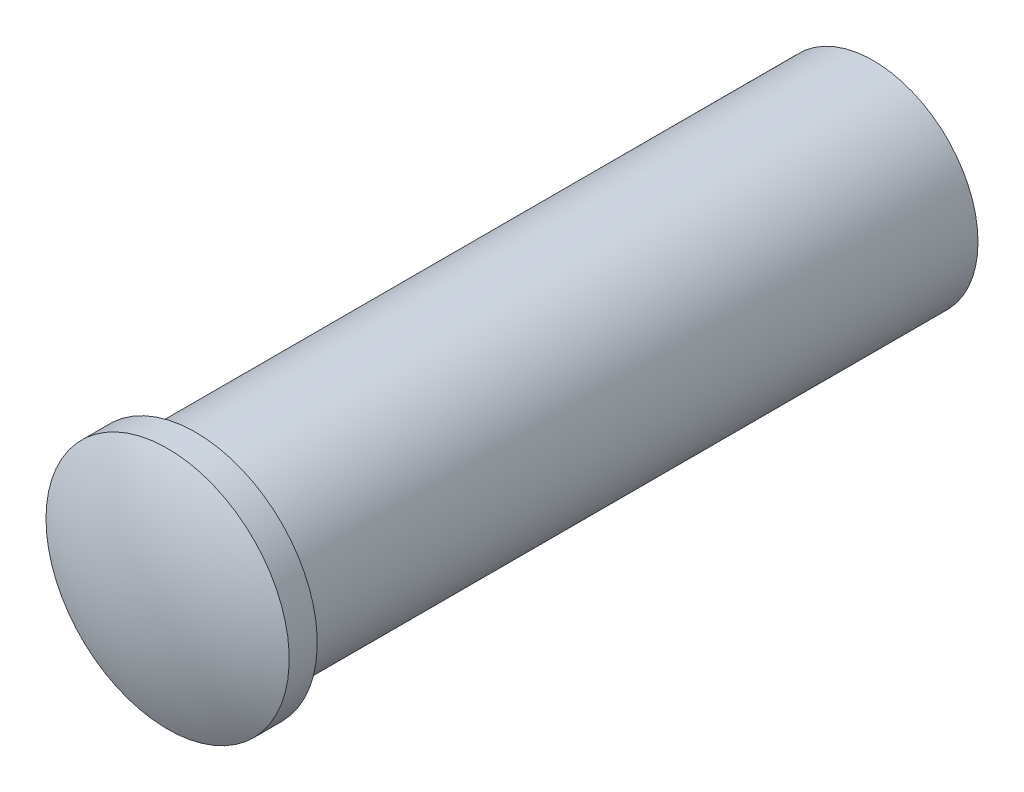
ISO-10303-21;
HEADER;
FILE_DESCRIPTION(('STEP AP214'),'2;1');
FILE_NAME('part.step','',(''),(''),'','','');
FILE_SCHEMA(('AUTOMOTIVE_DESIGN { 1 0 10303 214 1 1 1 1 }'));
ENDSEC;
DATA;
#1=APPLICATION_CONTEXT('core data for automotive mechanical design processes');
#2=APPLICATION_PROTOCOL_DEFINITION('international standard','automotive_design',2000,#1);
#3=PRODUCT_CONTEXT('',#1,'mechanical');
#4=PRODUCT('Part','Part','',(#3));
#5=PRODUCT_RELATED_PRODUCT_CATEGORY('part','',(#4));
#6=PRODUCT_DEFINITION_FORMATION('','',#4);
#7=PRODUCT_DEFINITION_CONTEXT('part definition',#1,'design');
#8=PRODUCT_DEFINITION('design','',#6,#7);
#9=PRODUCT_DEFINITION_SHAPE('','',#8);
#10=(LENGTH_UNIT() NAMED_UNIT(*) SI_UNIT(.MILLI.,.METRE.));
#11=(NAMED_UNIT(*) PLANE_ANGLE_UNIT() SI_UNIT($,.RADIAN.));
#12=(NAMED_UNIT(*) SI_UNIT($,.STERADIAN.) SOLID_ANGLE_UNIT());
#13=UNCERTAINTY_MEASURE_WITH_UNIT(LENGTH_MEASURE(1.E-05),#10,'distance_accuracy_value','');
#14=(GEOMETRIC_REPRESENTATION_CONTEXT(3) GLOBAL_UNCERTAINTY_ASSIGNED_CONTEXT((#13)) GLOBAL_UNIT_ASSIGNED_CONTEXT((#10,
#11,#12)) REPRESENTATION_CONTEXT('',''));
#15=CARTESIAN_POINT('',(0.,0.,0.));
#16=DIRECTION('',(0.,0.,1.));
#17=DIRECTION('',(1.,0.,0.));
#18=AXIS2_PLACEMENT_3D('',#15,#16,#17);
#19=CARTESIAN_POINT('',(0.,0.,0.194333333333337));
#20=DIRECTION('',(1.,0.,0.));
#21=DIRECTION('',(0.,0.,-1.));
#22=AXIS2_PLACEMENT_3D('',#19,#20,#21);
#23=SPHERICAL_SURFACE('',#22,3.76766666666666);
#24=CARTESIAN_POINT('',(0.,0.,3.581));
#25=DIRECTION('',(0.,0.,-1.));
#26=DIRECTION('',(-1.,0.,0.));
#27=AXIS2_PLACEMENT_3D('',#24,#25,#26);
#28=CIRCLE('',#27,1.651);
#29=CARTESIAN_POINT('',(-1.651,0.,3.581));
#30=VERTEX_POINT('',#29);
#31=EDGE_CURVE('E49',#30,#30,#28,.T.);
#32=ORIENTED_EDGE('',*,*,#31,.F.);
#33=EDGE_LOOP('',(#32));
#34=FACE_BOUND('',#33,.T.);
#35=ADVANCED_FACE('F33',(#34),#23,.T.);
#36=CARTESIAN_POINT('',(0.,0.,3.581));
#37=DIRECTION('',(0.,0.,-1.));
#38=DIRECTION('',(-1.,0.,0.));
#39=AXIS2_PLACEMENT_3D('',#36,#37,#38);
#40=CYLINDRICAL_SURFACE('',#39,1.651);
#41=ORIENTED_EDGE('',*,*,#31,.T.);
#42=EDGE_LOOP('',(#41));
#43=FACE_BOUND('',#42,.T.);
#44=CARTESIAN_POINT('',(0.,0.,3.2));
#45=DIRECTION('',(0.,0.,-1.));
#46=DIRECTION('',(-1.,0.,0.));
#47=AXIS2_PLACEMENT_3D('',#44,#45,#46);
#48=CIRCLE('',#47,1.651);
#49=CARTESIAN_POINT('',(-1.651,0.,3.2));
#50=VERTEX_POINT('',#49);
#51=EDGE_CURVE('E44',#50,#50,#48,.F.);
#52=ORIENTED_EDGE('',*,*,#51,.T.);
#53=EDGE_LOOP('',(#52));
#54=FACE_BOUND('',#53,.T.);
#55=ADVANCED_FACE('F56',(#43,#54),#40,.T.);
#56=CARTESIAN_POINT('',(0.,0.,3.2));
#57=DIRECTION('',(0.,0.,1.));
#58=DIRECTION('',(1.,0.,0.));
#59=AXIS2_PLACEMENT_3D('',#56,#57,#58);
#60=PLANE('',#59);
#61=CARTESIAN_POINT('',(0.,0.,3.2));
#62=DIRECTION('',(0.,0.,-1.));
#63=DIRECTION('',(-1.,0.,0.));
#64=AXIS2_PLACEMENT_3D('',#61,#62,#63);
#65=CIRCLE('',#64,1.4224);
#66=CARTESIAN_POINT('',(-1.4224,0.,3.2));
#67=VERTEX_POINT('',#66);
#68=EDGE_CURVE('E40',#67,#67,#65,.T.);
#69=ORIENTED_EDGE('',*,*,#68,.F.);
#70=EDGE_LOOP('',(#69));
#71=FACE_BOUND('',#70,.T.);
#72=ORIENTED_EDGE('',*,*,#51,.F.);
#73=EDGE_LOOP('',(#72));
#74=FACE_BOUND('',#73,.T.);
#75=ADVANCED_FACE('F63',(#71,#74),#60,.F.);
#76=CARTESIAN_POINT('',(0.,0.,-6.));
#77=DIRECTION('',(0.,0.,1.));
#78=DIRECTION('',(1.,0.,0.));
#79=AXIS2_PLACEMENT_3D('',#76,#77,#78);
#80=PLANE('',#79);
#81=CARTESIAN_POINT('',(0.,0.,-6.));
#82=DIRECTION('',(0.,0.,1.));
#83=DIRECTION('',(1.,0.,0.));
#84=AXIS2_PLACEMENT_3D('',#81,#82,#83);
#85=CIRCLE('',#84,1.4224);
#86=CARTESIAN_POINT('',(1.4224,0.,-6.));
#87=VERTEX_POINT('',#86);
#88=EDGE_CURVE('E11',#87,#87,#85,.T.);
#89=ORIENTED_EDGE('',*,*,#88,.F.);
#90=EDGE_LOOP('',(#89));
#91=FACE_BOUND('',#90,.T.);
#92=ADVANCED_FACE('F35',(#91),#80,.F.);
#93=CARTESIAN_POINT('',(0.,0.,3.2));
#94=DIRECTION('',(0.,0.,-1.));
#95=DIRECTION('',(-1.,0.,0.));
#96=AXIS2_PLACEMENT_3D('',#93,#94,#95);
#97=CYLINDRICAL_SURFACE('',#96,1.4224);
#98=ORIENTED_EDGE('',*,*,#88,.T.);
#99=EDGE_LOOP('',(#98));
#100=FACE_BOUND('',#99,.T.);
#101=ORIENTED_EDGE('',*,*,#68,.T.);
#102=EDGE_LOOP('',(#101));
#103=FACE_BOUND('',#102,.T.);
#104=ADVANCED_FACE('F65',(#100,#103),#97,.T.);
#105=CLOSED_SHELL('',(#35,#55,#75,#92,#104));
#106=MANIFOLD_SOLID_BREP('B2',#105);
#107=ADVANCED_BREP_SHAPE_REPRESENTATION('',(#18,#106),#14);
#108=SHAPE_DEFINITION_REPRESENTATION(#9,#107);
ENDSEC;
END-ISO-10303-21;
